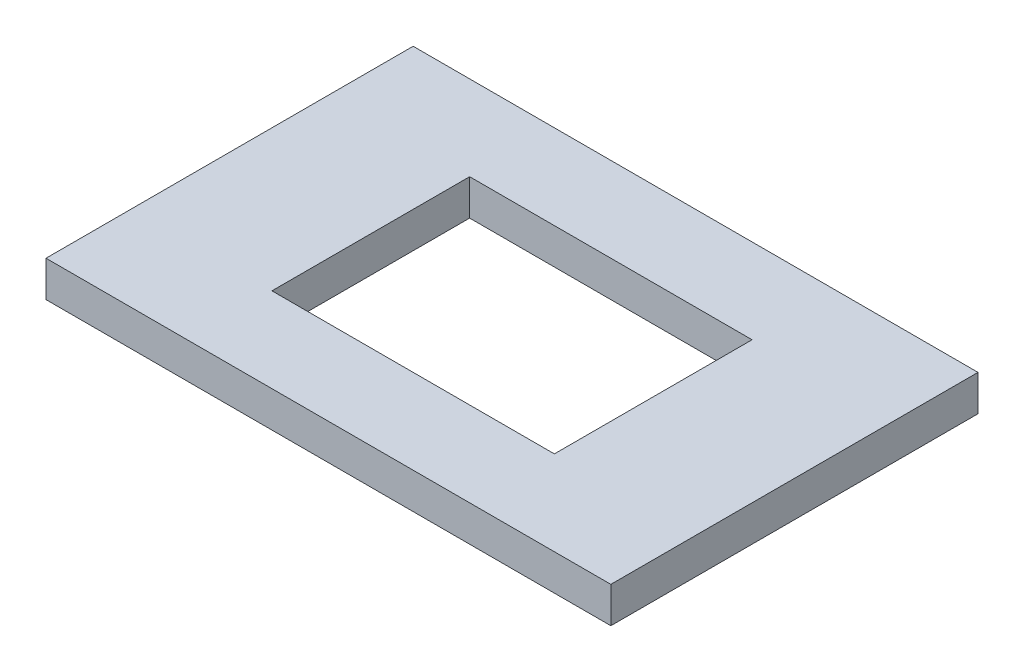
ISO-10303-21;
HEADER;
FILE_DESCRIPTION(('STEP AP214'),'2;1');
FILE_NAME('part.step','',(''),(''),'','','');
FILE_SCHEMA(('AUTOMOTIVE_DESIGN { 1 0 10303 214 1 1 1 1 }'));
ENDSEC;
DATA;
#1=APPLICATION_CONTEXT('core data for automotive mechanical design processes');
#2=APPLICATION_PROTOCOL_DEFINITION('international standard','automotive_design',2000,#1);
#3=PRODUCT_CONTEXT('',#1,'mechanical');
#4=PRODUCT('Part','Part','',(#3));
#5=PRODUCT_RELATED_PRODUCT_CATEGORY('part','',(#4));
#6=PRODUCT_DEFINITION_FORMATION('','',#4);
#7=PRODUCT_DEFINITION_CONTEXT('part definition',#1,'design');
#8=PRODUCT_DEFINITION('design','',#6,#7);
#9=PRODUCT_DEFINITION_SHAPE('','',#8);
#10=(LENGTH_UNIT() NAMED_UNIT(*) SI_UNIT(.MILLI.,.METRE.));
#11=(NAMED_UNIT(*) PLANE_ANGLE_UNIT() SI_UNIT($,.RADIAN.));
#12=(NAMED_UNIT(*) SI_UNIT($,.STERADIAN.) SOLID_ANGLE_UNIT());
#13=UNCERTAINTY_MEASURE_WITH_UNIT(LENGTH_MEASURE(1.E-05),#10,'distance_accuracy_value','');
#14=(GEOMETRIC_REPRESENTATION_CONTEXT(3) GLOBAL_UNCERTAINTY_ASSIGNED_CONTEXT((#13)) GLOBAL_UNIT_ASSIGNED_CONTEXT((#10,
#11,#12)) REPRESENTATION_CONTEXT('',''));
#15=CARTESIAN_POINT('',(0.,0.,0.));
#16=DIRECTION('',(0.,0.,1.));
#17=DIRECTION('',(1.,0.,0.));
#18=AXIS2_PLACEMENT_3D('',#15,#16,#17);
#19=CARTESIAN_POINT('',(-58.0800172577783,6.35,-28.3897327114432));
#20=DIRECTION('',(1.,0.,0.));
#21=DIRECTION('',(0.,0.,-1.));
#22=AXIS2_PLACEMENT_3D('',#19,#20,#21);
#23=PLANE('',#22);
#24=DIRECTION('',(0.,0.,1.));
#25=VECTOR('',#24,1.);
#26=CARTESIAN_POINT('',(-58.0800172577783,0.,-28.3897327114432));
#27=LINE('',#26,#25);
#28=CARTESIAN_POINT('',(-58.0800172577783,0.,-28.3897327114432));
#29=VERTEX_POINT('',#28);
#30=CARTESIAN_POINT('',(-58.0800172577783,0.,36.6102672885568));
#31=VERTEX_POINT('',#30);
#32=EDGE_CURVE('E138',#29,#31,#27,.T.);
#33=ORIENTED_EDGE('',*,*,#32,.T.);
#34=DIRECTION('',(0.,-1.,0.));
#35=VECTOR('',#34,1.);
#36=CARTESIAN_POINT('',(-58.0800172577783,6.35,36.6102672885568));
#37=LINE('',#36,#35);
#38=CARTESIAN_POINT('',(-58.0800172577783,6.35,36.6102672885568));
#39=VERTEX_POINT('',#38);
#40=EDGE_CURVE('E11',#39,#31,#37,.T.);
#41=ORIENTED_EDGE('',*,*,#40,.F.);
#42=DIRECTION('',(0.,0.,1.));
#43=VECTOR('',#42,1.);
#44=CARTESIAN_POINT('',(-58.0800172577783,6.35,-28.3897327114432));
#45=LINE('',#44,#43);
#46=CARTESIAN_POINT('',(-58.0800172577783,6.35,-28.3897327114432));
#47=VERTEX_POINT('',#46);
#48=EDGE_CURVE('E142',#47,#39,#45,.T.);
#49=ORIENTED_EDGE('',*,*,#48,.F.);
#50=DIRECTION('',(0.,-1.,0.));
#51=VECTOR('',#50,1.);
#52=CARTESIAN_POINT('',(-58.0800172577783,6.35,-28.3897327114432));
#53=LINE('',#52,#51);
#54=EDGE_CURVE('E152',#47,#29,#53,.T.);
#55=ORIENTED_EDGE('',*,*,#54,.T.);
#56=EDGE_LOOP('',(#33,#41,#49,#55));
#57=FACE_BOUND('',#56,.T.);
#58=ADVANCED_FACE('F41',(#57),#23,.F.);
#59=CARTESIAN_POINT('',(-58.0800172577783,6.35,36.6102672885568));
#60=DIRECTION('',(0.,0.,-1.));
#61=DIRECTION('',(-1.,0.,0.));
#62=AXIS2_PLACEMENT_3D('',#59,#60,#61);
#63=PLANE('',#62);
#64=DIRECTION('',(1.,0.,0.));
#65=VECTOR('',#64,1.);
#66=CARTESIAN_POINT('',(-58.0800172577783,0.,36.6102672885568));
#67=LINE('',#66,#65);
#68=CARTESIAN_POINT('',(41.9199827422217,0.,36.6102672885568));
#69=VERTEX_POINT('',#68);
#70=EDGE_CURVE('E155',#31,#69,#67,.T.);
#71=ORIENTED_EDGE('',*,*,#70,.T.);
#72=DIRECTION('',(0.,-1.,0.));
#73=VECTOR('',#72,1.);
#74=CARTESIAN_POINT('',(41.9199827422217,6.35,36.6102672885568));
#75=LINE('',#74,#73);
#76=CARTESIAN_POINT('',(41.9199827422217,6.35,36.6102672885568));
#77=VERTEX_POINT('',#76);
#78=EDGE_CURVE('E48',#77,#69,#75,.T.);
#79=ORIENTED_EDGE('',*,*,#78,.F.);
#80=DIRECTION('',(1.,0.,0.));
#81=VECTOR('',#80,1.);
#82=CARTESIAN_POINT('',(-58.0800172577783,6.35,36.6102672885568));
#83=LINE('',#82,#81);
#84=EDGE_CURVE('E145',#39,#77,#83,.T.);
#85=ORIENTED_EDGE('',*,*,#84,.F.);
#86=ORIENTED_EDGE('',*,*,#40,.T.);
#87=EDGE_LOOP('',(#71,#79,#85,#86));
#88=FACE_BOUND('',#87,.T.);
#89=ADVANCED_FACE('F183',(#88),#63,.F.);
#90=CARTESIAN_POINT('',(41.9199827422217,6.35,-28.3897327114432));
#91=DIRECTION('',(-1.,0.,0.));
#92=DIRECTION('',(0.,0.,1.));
#93=AXIS2_PLACEMENT_3D('',#90,#91,#92);
#94=PLANE('',#93);
#95=DIRECTION('',(0.,0.,-1.));
#96=VECTOR('',#95,1.);
#97=CARTESIAN_POINT('',(41.9199827422217,0.,-28.3897327114432));
#98=LINE('',#97,#96);
#99=CARTESIAN_POINT('',(41.9199827422217,0.,-28.3897327114432));
#100=VERTEX_POINT('',#99);
#101=EDGE_CURVE('E157',#69,#100,#98,.T.);
#102=ORIENTED_EDGE('',*,*,#101,.T.);
#103=DIRECTION('',(0.,-1.,0.));
#104=VECTOR('',#103,1.);
#105=CARTESIAN_POINT('',(41.9199827422217,6.35,-28.3897327114432));
#106=LINE('',#105,#104);
#107=CARTESIAN_POINT('',(41.9199827422217,6.35,-28.3897327114432));
#108=VERTEX_POINT('',#107);
#109=EDGE_CURVE('E162',#108,#100,#106,.T.);
#110=ORIENTED_EDGE('',*,*,#109,.F.);
#111=DIRECTION('',(0.,0.,-1.));
#112=VECTOR('',#111,1.);
#113=CARTESIAN_POINT('',(41.9199827422217,6.35,-28.3897327114432));
#114=LINE('',#113,#112);
#115=EDGE_CURVE('E148',#77,#108,#114,.T.);
#116=ORIENTED_EDGE('',*,*,#115,.F.);
#117=ORIENTED_EDGE('',*,*,#78,.T.);
#118=EDGE_LOOP('',(#102,#110,#116,#117));
#119=FACE_BOUND('',#118,.T.);
#120=ADVANCED_FACE('F169',(#119),#94,.F.);
#121=CARTESIAN_POINT('',(-58.0800172577783,6.35,-28.3897327114432));
#122=DIRECTION('',(0.,0.,1.));
#123=DIRECTION('',(1.,0.,0.));
#124=AXIS2_PLACEMENT_3D('',#121,#122,#123);
#125=PLANE('',#124);
#126=DIRECTION('',(-1.,0.,0.));
#127=VECTOR('',#126,1.);
#128=CARTESIAN_POINT('',(-58.0800172577783,0.,-28.3897327114432));
#129=LINE('',#128,#127);
#130=EDGE_CURVE('E146',#100,#29,#129,.T.);
#131=ORIENTED_EDGE('',*,*,#130,.T.);
#132=ORIENTED_EDGE('',*,*,#54,.F.);
#133=DIRECTION('',(-1.,0.,0.));
#134=VECTOR('',#133,1.);
#135=CARTESIAN_POINT('',(-58.0800172577783,6.35,-28.3897327114432));
#136=LINE('',#135,#134);
#137=EDGE_CURVE('E150',#108,#47,#136,.T.);
#138=ORIENTED_EDGE('',*,*,#137,.F.);
#139=ORIENTED_EDGE('',*,*,#109,.T.);
#140=EDGE_LOOP('',(#131,#132,#138,#139));
#141=FACE_BOUND('',#140,.T.);
#142=ADVANCED_FACE('F176',(#141),#125,.F.);
#143=CARTESIAN_POINT('',(0.,6.35,0.));
#144=DIRECTION('',(0.,1.,0.));
#145=DIRECTION('',(0.,0.,1.));
#146=AXIS2_PLACEMENT_3D('',#143,#144,#145);
#147=PLANE('',#146);
#148=DIRECTION('',(0.,0.,1.));
#149=VECTOR('',#148,1.);
#150=CARTESIAN_POINT('',(-33.0800172577783,6.35,-13.3897327114432));
#151=LINE('',#150,#149);
#152=CARTESIAN_POINT('',(-33.0800172577783,6.35,-13.3897327114432));
#153=VERTEX_POINT('',#152);
#154=CARTESIAN_POINT('',(-33.0800172577783,6.35,21.6102672885568));
#155=VERTEX_POINT('',#154);
#156=EDGE_CURVE('E55',#153,#155,#151,.T.);
#157=ORIENTED_EDGE('',*,*,#156,.F.);
#158=DIRECTION('',(-1.,0.,0.));
#159=VECTOR('',#158,1.);
#160=CARTESIAN_POINT('',(-33.0800172577783,6.35,-13.3897327114432));
#161=LINE('',#160,#159);
#162=CARTESIAN_POINT('',(16.9199827422217,6.35,-13.3897327114432));
#163=VERTEX_POINT('',#162);
#164=EDGE_CURVE('E123',#163,#153,#161,.T.);
#165=ORIENTED_EDGE('',*,*,#164,.F.);
#166=DIRECTION('',(0.,0.,-1.));
#167=VECTOR('',#166,1.);
#168=CARTESIAN_POINT('',(16.9199827422217,6.35,-13.3897327114432));
#169=LINE('',#168,#167);
#170=CARTESIAN_POINT('',(16.9199827422217,6.35,21.6102672885568));
#171=VERTEX_POINT('',#170);
#172=EDGE_CURVE('E126',#171,#163,#169,.T.);
#173=ORIENTED_EDGE('',*,*,#172,.F.);
#174=DIRECTION('',(1.,0.,0.));
#175=VECTOR('',#174,1.);
#176=CARTESIAN_POINT('',(-33.0800172577783,6.35,21.6102672885568));
#177=LINE('',#176,#175);
#178=EDGE_CURVE('E132',#155,#171,#177,.T.);
#179=ORIENTED_EDGE('',*,*,#178,.F.);
#180=EDGE_LOOP('',(#157,#165,#173,#179));
#181=FACE_BOUND('',#180,.T.);
#182=ORIENTED_EDGE('',*,*,#48,.T.);
#183=ORIENTED_EDGE('',*,*,#84,.T.);
#184=ORIENTED_EDGE('',*,*,#115,.T.);
#185=ORIENTED_EDGE('',*,*,#137,.T.);
#186=EDGE_LOOP('',(#182,#183,#184,#185));
#187=FACE_BOUND('',#186,.T.);
#188=ADVANCED_FACE('F182',(#181,#187),#147,.T.);
#189=CARTESIAN_POINT('',(0.,0.,0.));
#190=DIRECTION('',(0.,1.,0.));
#191=DIRECTION('',(0.,0.,1.));
#192=AXIS2_PLACEMENT_3D('',#189,#190,#191);
#193=PLANE('',#192);
#194=DIRECTION('',(-1.,0.,0.));
#195=VECTOR('',#194,1.);
#196=CARTESIAN_POINT('',(-33.0800172577783,0.,-13.3897327114432));
#197=LINE('',#196,#195);
#198=CARTESIAN_POINT('',(16.9199827422217,0.,-13.3897327114432));
#199=VERTEX_POINT('',#198);
#200=CARTESIAN_POINT('',(-33.0800172577783,0.,-13.3897327114432));
#201=VERTEX_POINT('',#200);
#202=EDGE_CURVE('E113',#199,#201,#197,.T.);
#203=ORIENTED_EDGE('',*,*,#202,.T.);
#204=DIRECTION('',(0.,0.,1.));
#205=VECTOR('',#204,1.);
#206=CARTESIAN_POINT('',(-33.0800172577783,0.,-13.3897327114432));
#207=LINE('',#206,#205);
#208=CARTESIAN_POINT('',(-33.0800172577783,0.,21.6102672885568));
#209=VERTEX_POINT('',#208);
#210=EDGE_CURVE('E107',#201,#209,#207,.T.);
#211=ORIENTED_EDGE('',*,*,#210,.T.);
#212=DIRECTION('',(1.,0.,0.));
#213=VECTOR('',#212,1.);
#214=CARTESIAN_POINT('',(-33.0800172577783,0.,21.6102672885568));
#215=LINE('',#214,#213);
#216=CARTESIAN_POINT('',(16.9199827422217,0.,21.6102672885568));
#217=VERTEX_POINT('',#216);
#218=EDGE_CURVE('E116',#209,#217,#215,.T.);
#219=ORIENTED_EDGE('',*,*,#218,.T.);
#220=DIRECTION('',(0.,0.,-1.));
#221=VECTOR('',#220,1.);
#222=CARTESIAN_POINT('',(16.9199827422217,0.,-13.3897327114432));
#223=LINE('',#222,#221);
#224=EDGE_CURVE('E63',#217,#199,#223,.T.);
#225=ORIENTED_EDGE('',*,*,#224,.T.);
#226=EDGE_LOOP('',(#203,#211,#219,#225));
#227=FACE_BOUND('',#226,.T.);
#228=ORIENTED_EDGE('',*,*,#32,.F.);
#229=ORIENTED_EDGE('',*,*,#130,.F.);
#230=ORIENTED_EDGE('',*,*,#101,.F.);
#231=ORIENTED_EDGE('',*,*,#70,.F.);
#232=EDGE_LOOP('',(#228,#229,#230,#231));
#233=FACE_BOUND('',#232,.T.);
#234=ADVANCED_FACE('F120',(#227,#233),#193,.F.);
#235=CARTESIAN_POINT('',(-33.0800172577783,0.,-13.3897327114432));
#236=DIRECTION('',(-1.,0.,0.));
#237=DIRECTION('',(0.,0.,1.));
#238=AXIS2_PLACEMENT_3D('',#235,#236,#237);
#239=PLANE('',#238);
#240=ORIENTED_EDGE('',*,*,#156,.T.);
#241=DIRECTION('',(0.,1.,0.));
#242=VECTOR('',#241,1.);
#243=CARTESIAN_POINT('',(-33.0800172577783,0.,21.6102672885568));
#244=LINE('',#243,#242);
#245=EDGE_CURVE('E103',#209,#155,#244,.T.);
#246=ORIENTED_EDGE('',*,*,#245,.F.);
#247=ORIENTED_EDGE('',*,*,#210,.F.);
#248=DIRECTION('',(0.,1.,0.));
#249=VECTOR('',#248,1.);
#250=CARTESIAN_POINT('',(-33.0800172577783,0.,-13.3897327114432));
#251=LINE('',#250,#249);
#252=EDGE_CURVE('E136',#201,#153,#251,.T.);
#253=ORIENTED_EDGE('',*,*,#252,.T.);
#254=EDGE_LOOP('',(#240,#246,#247,#253));
#255=FACE_BOUND('',#254,.T.);
#256=ADVANCED_FACE('F105',(#255),#239,.F.);
#257=CARTESIAN_POINT('',(-33.0800172577783,0.,-13.3897327114432));
#258=DIRECTION('',(0.,0.,-1.));
#259=DIRECTION('',(-1.,0.,0.));
#260=AXIS2_PLACEMENT_3D('',#257,#258,#259);
#261=PLANE('',#260);
#262=ORIENTED_EDGE('',*,*,#164,.T.);
#263=ORIENTED_EDGE('',*,*,#252,.F.);
#264=ORIENTED_EDGE('',*,*,#202,.F.);
#265=DIRECTION('',(0.,1.,0.));
#266=VECTOR('',#265,1.);
#267=CARTESIAN_POINT('',(16.9199827422217,0.,-13.3897327114432));
#268=LINE('',#267,#266);
#269=EDGE_CURVE('E139',#199,#163,#268,.T.);
#270=ORIENTED_EDGE('',*,*,#269,.T.);
#271=EDGE_LOOP('',(#262,#263,#264,#270));
#272=FACE_BOUND('',#271,.T.);
#273=ADVANCED_FACE('F200',(#272),#261,.F.);
#274=CARTESIAN_POINT('',(16.9199827422217,0.,-13.3897327114432));
#275=DIRECTION('',(1.,0.,0.));
#276=DIRECTION('',(0.,0.,-1.));
#277=AXIS2_PLACEMENT_3D('',#274,#275,#276);
#278=PLANE('',#277);
#279=ORIENTED_EDGE('',*,*,#172,.T.);
#280=ORIENTED_EDGE('',*,*,#269,.F.);
#281=ORIENTED_EDGE('',*,*,#224,.F.);
#282=DIRECTION('',(0.,1.,0.));
#283=VECTOR('',#282,1.);
#284=CARTESIAN_POINT('',(16.9199827422217,0.,21.6102672885568));
#285=LINE('',#284,#283);
#286=EDGE_CURVE('E112',#217,#171,#285,.T.);
#287=ORIENTED_EDGE('',*,*,#286,.T.);
#288=EDGE_LOOP('',(#279,#280,#281,#287));
#289=FACE_BOUND('',#288,.T.);
#290=ADVANCED_FACE('F203',(#289),#278,.F.);
#291=CARTESIAN_POINT('',(-33.0800172577783,0.,21.6102672885568));
#292=DIRECTION('',(0.,0.,1.));
#293=DIRECTION('',(1.,0.,0.));
#294=AXIS2_PLACEMENT_3D('',#291,#292,#293);
#295=PLANE('',#294);
#296=ORIENTED_EDGE('',*,*,#178,.T.);
#297=ORIENTED_EDGE('',*,*,#286,.F.);
#298=ORIENTED_EDGE('',*,*,#218,.F.);
#299=ORIENTED_EDGE('',*,*,#245,.T.);
#300=EDGE_LOOP('',(#296,#297,#298,#299));
#301=FACE_BOUND('',#300,.T.);
#302=ADVANCED_FACE('F117',(#301),#295,.F.);
#303=CLOSED_SHELL('',(#58,#89,#120,#142,#188,#234,#256,#273,#290,#302));
#304=MANIFOLD_SOLID_BREP('B2',#303);
#305=ADVANCED_BREP_SHAPE_REPRESENTATION('',(#18,#304),#14);
#306=SHAPE_DEFINITION_REPRESENTATION(#9,#305);
ENDSEC;
END-ISO-10303-21;
